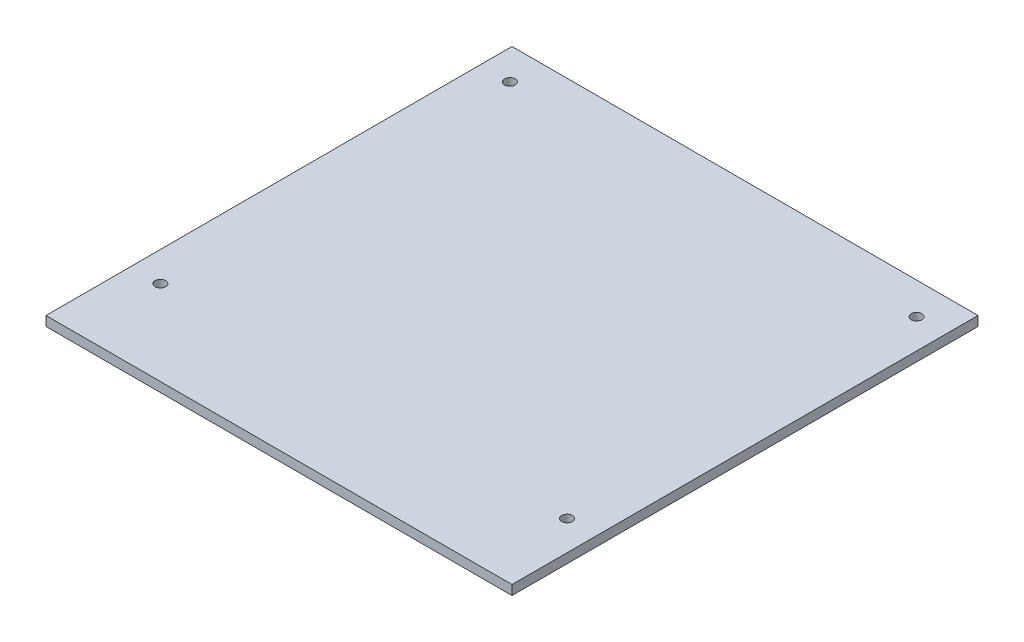
ISO-10303-21;
HEADER;
FILE_DESCRIPTION(('STEP AP214'),'2;1');
FILE_NAME('part.step','',(''),(''),'','','');
FILE_SCHEMA(('AUTOMOTIVE_DESIGN { 1 0 10303 214 1 1 1 1 }'));
ENDSEC;
DATA;
#1=APPLICATION_CONTEXT('core data for automotive mechanical design processes');
#2=APPLICATION_PROTOCOL_DEFINITION('international standard','automotive_design',2000,#1);
#3=PRODUCT_CONTEXT('',#1,'mechanical');
#4=PRODUCT('Part','Part','',(#3));
#5=PRODUCT_RELATED_PRODUCT_CATEGORY('part','',(#4));
#6=PRODUCT_DEFINITION_FORMATION('','',#4);
#7=PRODUCT_DEFINITION_CONTEXT('part definition',#1,'design');
#8=PRODUCT_DEFINITION('design','',#6,#7);
#9=PRODUCT_DEFINITION_SHAPE('','',#8);
#10=(LENGTH_UNIT() NAMED_UNIT(*) SI_UNIT(.MILLI.,.METRE.));
#11=(NAMED_UNIT(*) PLANE_ANGLE_UNIT() SI_UNIT($,.RADIAN.));
#12=(NAMED_UNIT(*) SI_UNIT($,.STERADIAN.) SOLID_ANGLE_UNIT());
#13=UNCERTAINTY_MEASURE_WITH_UNIT(LENGTH_MEASURE(1.E-05),#10,'distance_accuracy_value','');
#14=(GEOMETRIC_REPRESENTATION_CONTEXT(3) GLOBAL_UNCERTAINTY_ASSIGNED_CONTEXT((#13)) GLOBAL_UNIT_ASSIGNED_CONTEXT((#10,
#11,#12)) REPRESENTATION_CONTEXT('',''));
#15=CARTESIAN_POINT('',(0.,0.,0.));
#16=DIRECTION('',(0.,0.,1.));
#17=DIRECTION('',(1.,0.,0.));
#18=AXIS2_PLACEMENT_3D('',#15,#16,#17);
#19=CARTESIAN_POINT('',(110.,4.5,110.));
#20=DIRECTION('',(-1.,0.,0.));
#21=DIRECTION('',(0.,0.,1.));
#22=AXIS2_PLACEMENT_3D('',#19,#20,#21);
#23=PLANE('',#22);
#24=DIRECTION('',(0.,0.,-1.));
#25=VECTOR('',#24,1.);
#26=CARTESIAN_POINT('',(110.,0.,110.));
#27=LINE('',#26,#25);
#28=CARTESIAN_POINT('',(110.,0.,110.));
#29=VERTEX_POINT('',#28);
#30=CARTESIAN_POINT('',(110.,0.,-110.));
#31=VERTEX_POINT('',#30);
#32=EDGE_CURVE('E107',#29,#31,#27,.T.);
#33=ORIENTED_EDGE('',*,*,#32,.T.);
#34=DIRECTION('',(0.,-1.,0.));
#35=VECTOR('',#34,1.);
#36=CARTESIAN_POINT('',(110.,4.5,-110.));
#37=LINE('',#36,#35);
#38=CARTESIAN_POINT('',(110.,4.5,-110.));
#39=VERTEX_POINT('',#38);
#40=EDGE_CURVE('E13',#39,#31,#37,.T.);
#41=ORIENTED_EDGE('',*,*,#40,.F.);
#42=DIRECTION('',(0.,0.,-1.));
#43=VECTOR('',#42,1.);
#44=CARTESIAN_POINT('',(110.,4.5,110.));
#45=LINE('',#44,#43);
#46=CARTESIAN_POINT('',(110.,4.5,110.));
#47=VERTEX_POINT('',#46);
#48=EDGE_CURVE('E95',#47,#39,#45,.T.);
#49=ORIENTED_EDGE('',*,*,#48,.F.);
#50=DIRECTION('',(0.,-1.,0.));
#51=VECTOR('',#50,1.);
#52=CARTESIAN_POINT('',(110.,4.5,110.));
#53=LINE('',#52,#51);
#54=EDGE_CURVE('E103',#47,#29,#53,.T.);
#55=ORIENTED_EDGE('',*,*,#54,.T.);
#56=EDGE_LOOP('',(#33,#41,#49,#55));
#57=FACE_BOUND('',#56,.T.);
#58=ADVANCED_FACE('F44',(#57),#23,.F.);
#59=CARTESIAN_POINT('',(-110.,4.5,-110.));
#60=DIRECTION('',(0.,0.,1.));
#61=DIRECTION('',(1.,0.,0.));
#62=AXIS2_PLACEMENT_3D('',#59,#60,#61);
#63=PLANE('',#62);
#64=DIRECTION('',(-1.,0.,0.));
#65=VECTOR('',#64,1.);
#66=CARTESIAN_POINT('',(-110.,0.,-110.));
#67=LINE('',#66,#65);
#68=CARTESIAN_POINT('',(-110.,0.,-110.));
#69=VERTEX_POINT('',#68);
#70=EDGE_CURVE('E99',#31,#69,#67,.T.);
#71=ORIENTED_EDGE('',*,*,#70,.T.);
#72=DIRECTION('',(0.,-1.,0.));
#73=VECTOR('',#72,1.);
#74=CARTESIAN_POINT('',(-110.,4.5,-110.));
#75=LINE('',#74,#73);
#76=CARTESIAN_POINT('',(-110.,4.5,-110.));
#77=VERTEX_POINT('',#76);
#78=EDGE_CURVE('E52',#77,#69,#75,.T.);
#79=ORIENTED_EDGE('',*,*,#78,.F.);
#80=DIRECTION('',(-1.,0.,0.));
#81=VECTOR('',#80,1.);
#82=CARTESIAN_POINT('',(-110.,4.5,-110.));
#83=LINE('',#82,#81);
#84=EDGE_CURVE('E90',#39,#77,#83,.T.);
#85=ORIENTED_EDGE('',*,*,#84,.F.);
#86=ORIENTED_EDGE('',*,*,#40,.T.);
#87=EDGE_LOOP('',(#71,#79,#85,#86));
#88=FACE_BOUND('',#87,.T.);
#89=ADVANCED_FACE('F98',(#88),#63,.F.);
#90=CARTESIAN_POINT('',(-110.,4.5,110.));
#91=DIRECTION('',(1.,0.,0.));
#92=DIRECTION('',(0.,0.,-1.));
#93=AXIS2_PLACEMENT_3D('',#90,#91,#92);
#94=PLANE('',#93);
#95=DIRECTION('',(0.,0.,1.));
#96=VECTOR('',#95,1.);
#97=CARTESIAN_POINT('',(-110.,0.,110.));
#98=LINE('',#97,#96);
#99=CARTESIAN_POINT('',(-110.,0.,110.));
#100=VERTEX_POINT('',#99);
#101=EDGE_CURVE('E77',#69,#100,#98,.T.);
#102=ORIENTED_EDGE('',*,*,#101,.T.);
#103=DIRECTION('',(0.,-1.,0.));
#104=VECTOR('',#103,1.);
#105=CARTESIAN_POINT('',(-110.,4.5,110.));
#106=LINE('',#105,#104);
#107=CARTESIAN_POINT('',(-110.,4.5,110.));
#108=VERTEX_POINT('',#107);
#109=EDGE_CURVE('E100',#108,#100,#106,.T.);
#110=ORIENTED_EDGE('',*,*,#109,.F.);
#111=DIRECTION('',(0.,0.,1.));
#112=VECTOR('',#111,1.);
#113=CARTESIAN_POINT('',(-110.,4.5,110.));
#114=LINE('',#113,#112);
#115=EDGE_CURVE('E93',#77,#108,#114,.T.);
#116=ORIENTED_EDGE('',*,*,#115,.F.);
#117=ORIENTED_EDGE('',*,*,#78,.T.);
#118=EDGE_LOOP('',(#102,#110,#116,#117));
#119=FACE_BOUND('',#118,.T.);
#120=ADVANCED_FACE('F101',(#119),#94,.F.);
#121=CARTESIAN_POINT('',(-110.,4.5,110.));
#122=DIRECTION('',(0.,0.,-1.));
#123=DIRECTION('',(-1.,0.,0.));
#124=AXIS2_PLACEMENT_3D('',#121,#122,#123);
#125=PLANE('',#124);
#126=DIRECTION('',(1.,0.,0.));
#127=VECTOR('',#126,1.);
#128=CARTESIAN_POINT('',(-110.,0.,110.));
#129=LINE('',#128,#127);
#130=EDGE_CURVE('E83',#100,#29,#129,.T.);
#131=ORIENTED_EDGE('',*,*,#130,.T.);
#132=ORIENTED_EDGE('',*,*,#54,.F.);
#133=DIRECTION('',(1.,0.,0.));
#134=VECTOR('',#133,1.);
#135=CARTESIAN_POINT('',(-110.,4.5,110.));
#136=LINE('',#135,#134);
#137=EDGE_CURVE('E60',#108,#47,#136,.T.);
#138=ORIENTED_EDGE('',*,*,#137,.F.);
#139=ORIENTED_EDGE('',*,*,#109,.T.);
#140=EDGE_LOOP('',(#131,#132,#138,#139));
#141=FACE_BOUND('',#140,.T.);
#142=ADVANCED_FACE('F115',(#141),#125,.F.);
#143=CARTESIAN_POINT('',(0.,4.5,0.));
#144=DIRECTION('',(0.,-1.,0.));
#145=DIRECTION('',(0.,0.,-1.));
#146=AXIS2_PLACEMENT_3D('',#143,#144,#145);
#147=PLANE('',#146);
#148=CARTESIAN_POINT('',(-96.,4.5,70.));
#149=DIRECTION('',(0.,1.,0.));
#150=DIRECTION('',(0.,0.,1.));
#151=AXIS2_PLACEMENT_3D('',#148,#149,#150);
#152=CIRCLE('',#151,2.5);
#153=CARTESIAN_POINT('',(-96.,4.5,72.5));
#154=VERTEX_POINT('',#153);
#155=EDGE_CURVE('E139',#154,#154,#152,.T.);
#156=ORIENTED_EDGE('',*,*,#155,.F.);
#157=EDGE_LOOP('',(#156));
#158=FACE_BOUND('',#157,.T.);
#159=CARTESIAN_POINT('',(-96.,4.5,-95.));
#160=DIRECTION('',(0.,1.,0.));
#161=DIRECTION('',(0.,0.,1.));
#162=AXIS2_PLACEMENT_3D('',#159,#160,#161);
#163=CIRCLE('',#162,2.5);
#164=CARTESIAN_POINT('',(-96.,4.5,-92.5));
#165=VERTEX_POINT('',#164);
#166=EDGE_CURVE('E133',#165,#165,#163,.T.);
#167=ORIENTED_EDGE('',*,*,#166,.F.);
#168=EDGE_LOOP('',(#167));
#169=FACE_BOUND('',#168,.T.);
#170=CARTESIAN_POINT('',(96.,4.5,-94.9999999999999));
#171=DIRECTION('',(0.,1.,0.));
#172=DIRECTION('',(0.,0.,1.));
#173=AXIS2_PLACEMENT_3D('',#170,#171,#172);
#174=CIRCLE('',#173,2.49999999999998);
#175=CARTESIAN_POINT('',(96.,4.5,-92.4999999999999));
#176=VERTEX_POINT('',#175);
#177=EDGE_CURVE('E127',#176,#176,#174,.T.);
#178=ORIENTED_EDGE('',*,*,#177,.F.);
#179=EDGE_LOOP('',(#178));
#180=FACE_BOUND('',#179,.T.);
#181=CARTESIAN_POINT('',(96.,4.5,70.));
#182=DIRECTION('',(0.,1.,0.));
#183=DIRECTION('',(0.,0.,1.));
#184=AXIS2_PLACEMENT_3D('',#181,#182,#183);
#185=CIRCLE('',#184,2.5);
#186=CARTESIAN_POINT('',(96.,4.5,72.5));
#187=VERTEX_POINT('',#186);
#188=EDGE_CURVE('E121',#187,#187,#185,.T.);
#189=ORIENTED_EDGE('',*,*,#188,.F.);
#190=EDGE_LOOP('',(#189));
#191=FACE_BOUND('',#190,.T.);
#192=ORIENTED_EDGE('',*,*,#48,.T.);
#193=ORIENTED_EDGE('',*,*,#84,.T.);
#194=ORIENTED_EDGE('',*,*,#115,.T.);
#195=ORIENTED_EDGE('',*,*,#137,.T.);
#196=EDGE_LOOP('',(#192,#193,#194,#195));
#197=FACE_BOUND('',#196,.T.);
#198=ADVANCED_FACE('F91',(#158,#169,#180,#191,#197),#147,.F.);
#199=CARTESIAN_POINT('',(0.,0.,0.));
#200=DIRECTION('',(0.,-1.,0.));
#201=DIRECTION('',(0.,0.,-1.));
#202=AXIS2_PLACEMENT_3D('',#199,#200,#201);
#203=PLANE('',#202);
#204=CARTESIAN_POINT('',(-96.,0.,70.));
#205=DIRECTION('',(0.,1.,0.));
#206=DIRECTION('',(0.,0.,1.));
#207=AXIS2_PLACEMENT_3D('',#204,#205,#206);
#208=CIRCLE('',#207,2.5);
#209=CARTESIAN_POINT('',(-96.,0.,72.5));
#210=VERTEX_POINT('',#209);
#211=EDGE_CURVE('E124',#210,#210,#208,.T.);
#212=ORIENTED_EDGE('',*,*,#211,.T.);
#213=EDGE_LOOP('',(#212));
#214=FACE_BOUND('',#213,.T.);
#215=CARTESIAN_POINT('',(-96.,0.,-95.));
#216=DIRECTION('',(0.,1.,0.));
#217=DIRECTION('',(0.,0.,1.));
#218=AXIS2_PLACEMENT_3D('',#215,#216,#217);
#219=CIRCLE('',#218,2.5);
#220=CARTESIAN_POINT('',(-96.,0.,-92.5));
#221=VERTEX_POINT('',#220);
#222=EDGE_CURVE('E136',#221,#221,#219,.T.);
#223=ORIENTED_EDGE('',*,*,#222,.T.);
#224=EDGE_LOOP('',(#223));
#225=FACE_BOUND('',#224,.T.);
#226=CARTESIAN_POINT('',(96.,0.,-94.9999999999999));
#227=DIRECTION('',(0.,1.,0.));
#228=DIRECTION('',(0.,0.,1.));
#229=AXIS2_PLACEMENT_3D('',#226,#227,#228);
#230=CIRCLE('',#229,2.49999999999998);
#231=CARTESIAN_POINT('',(96.,0.,-92.4999999999999));
#232=VERTEX_POINT('',#231);
#233=EDGE_CURVE('E130',#232,#232,#230,.T.);
#234=ORIENTED_EDGE('',*,*,#233,.T.);
#235=EDGE_LOOP('',(#234));
#236=FACE_BOUND('',#235,.T.);
#237=CARTESIAN_POINT('',(96.,0.,70.));
#238=DIRECTION('',(0.,1.,0.));
#239=DIRECTION('',(0.,0.,1.));
#240=AXIS2_PLACEMENT_3D('',#237,#238,#239);
#241=CIRCLE('',#240,2.5);
#242=CARTESIAN_POINT('',(96.,0.,72.5));
#243=VERTEX_POINT('',#242);
#244=EDGE_CURVE('E110',#243,#243,#241,.T.);
#245=ORIENTED_EDGE('',*,*,#244,.T.);
#246=EDGE_LOOP('',(#245));
#247=FACE_BOUND('',#246,.T.);
#248=ORIENTED_EDGE('',*,*,#32,.F.);
#249=ORIENTED_EDGE('',*,*,#130,.F.);
#250=ORIENTED_EDGE('',*,*,#101,.F.);
#251=ORIENTED_EDGE('',*,*,#70,.F.);
#252=EDGE_LOOP('',(#248,#249,#250,#251));
#253=FACE_BOUND('',#252,.T.);
#254=ADVANCED_FACE('F118',(#214,#225,#236,#247,#253),#203,.T.);
#255=CARTESIAN_POINT('',(96.,0.,70.));
#256=DIRECTION('',(0.,1.,0.));
#257=DIRECTION('',(0.,0.,1.));
#258=AXIS2_PLACEMENT_3D('',#255,#256,#257);
#259=CYLINDRICAL_SURFACE('',#258,2.5);
#260=ORIENTED_EDGE('',*,*,#244,.F.);
#261=EDGE_LOOP('',(#260));
#262=FACE_BOUND('',#261,.T.);
#263=ORIENTED_EDGE('',*,*,#188,.T.);
#264=EDGE_LOOP('',(#263));
#265=FACE_BOUND('',#264,.T.);
#266=ADVANCED_FACE('F163',(#262,#265),#259,.F.);
#267=CARTESIAN_POINT('',(96.,0.,-94.9999999999999));
#268=DIRECTION('',(0.,1.,0.));
#269=DIRECTION('',(0.,0.,1.));
#270=AXIS2_PLACEMENT_3D('',#267,#268,#269);
#271=CYLINDRICAL_SURFACE('',#270,2.49999999999998);
#272=ORIENTED_EDGE('',*,*,#233,.F.);
#273=EDGE_LOOP('',(#272));
#274=FACE_BOUND('',#273,.T.);
#275=ORIENTED_EDGE('',*,*,#177,.T.);
#276=EDGE_LOOP('',(#275));
#277=FACE_BOUND('',#276,.T.);
#278=ADVANCED_FACE('F165',(#274,#277),#271,.F.);
#279=CARTESIAN_POINT('',(-96.,0.,-95.));
#280=DIRECTION('',(0.,1.,0.));
#281=DIRECTION('',(0.,0.,1.));
#282=AXIS2_PLACEMENT_3D('',#279,#280,#281);
#283=CYLINDRICAL_SURFACE('',#282,2.5);
#284=ORIENTED_EDGE('',*,*,#222,.F.);
#285=EDGE_LOOP('',(#284));
#286=FACE_BOUND('',#285,.T.);
#287=ORIENTED_EDGE('',*,*,#166,.T.);
#288=EDGE_LOOP('',(#287));
#289=FACE_BOUND('',#288,.T.);
#290=ADVANCED_FACE('F150',(#286,#289),#283,.F.);
#291=CARTESIAN_POINT('',(-96.,0.,70.));
#292=DIRECTION('',(0.,1.,0.));
#293=DIRECTION('',(0.,0.,1.));
#294=AXIS2_PLACEMENT_3D('',#291,#292,#293);
#295=CYLINDRICAL_SURFACE('',#294,2.5);
#296=ORIENTED_EDGE('',*,*,#211,.F.);
#297=EDGE_LOOP('',(#296));
#298=FACE_BOUND('',#297,.T.);
#299=ORIENTED_EDGE('',*,*,#155,.T.);
#300=EDGE_LOOP('',(#299));
#301=FACE_BOUND('',#300,.T.);
#302=ADVANCED_FACE('F147',(#298,#301),#295,.F.);
#303=CLOSED_SHELL('',(#58,#89,#120,#142,#198,#254,#266,#278,#290,#302));
#304=MANIFOLD_SOLID_BREP('B2',#303);
#305=ADVANCED_BREP_SHAPE_REPRESENTATION('',(#18,#304),#14);
#306=SHAPE_DEFINITION_REPRESENTATION(#9,#305);
ENDSEC;
END-ISO-10303-21;
